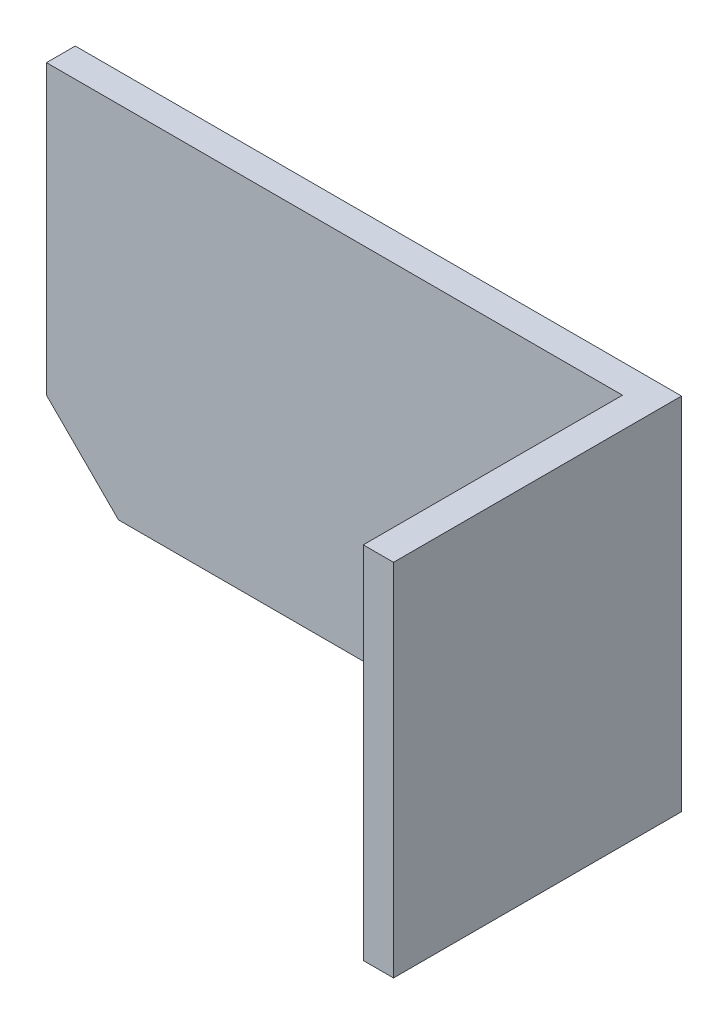
ISO-10303-21;
HEADER;
FILE_DESCRIPTION(('STEP AP214'),'2;1');
FILE_NAME('part.step','',(''),(''),'','','');
FILE_SCHEMA(('AUTOMOTIVE_DESIGN { 1 0 10303 214 1 1 1 1 }'));
ENDSEC;
DATA;
#1=APPLICATION_CONTEXT('core data for automotive mechanical design processes');
#2=APPLICATION_PROTOCOL_DEFINITION('international standard','automotive_design',2000,#1);
#3=PRODUCT_CONTEXT('',#1,'mechanical');
#4=PRODUCT('Part','Part','',(#3));
#5=PRODUCT_RELATED_PRODUCT_CATEGORY('part','',(#4));
#6=PRODUCT_DEFINITION_FORMATION('','',#4);
#7=PRODUCT_DEFINITION_CONTEXT('part definition',#1,'design');
#8=PRODUCT_DEFINITION('design','',#6,#7);
#9=PRODUCT_DEFINITION_SHAPE('','',#8);
#10=(LENGTH_UNIT() NAMED_UNIT(*) SI_UNIT(.MILLI.,.METRE.));
#11=(NAMED_UNIT(*) PLANE_ANGLE_UNIT() SI_UNIT($,.RADIAN.));
#12=(NAMED_UNIT(*) SI_UNIT($,.STERADIAN.) SOLID_ANGLE_UNIT());
#13=UNCERTAINTY_MEASURE_WITH_UNIT(LENGTH_MEASURE(1.E-05),#10,'distance_accuracy_value','');
#14=(GEOMETRIC_REPRESENTATION_CONTEXT(3) GLOBAL_UNCERTAINTY_ASSIGNED_CONTEXT((#13)) GLOBAL_UNIT_ASSIGNED_CONTEXT((#10,
#11,#12)) REPRESENTATION_CONTEXT('',''));
#15=CARTESIAN_POINT('',(0.,0.,0.));
#16=DIRECTION('',(0.,0.,1.));
#17=DIRECTION('',(1.,0.,0.));
#18=AXIS2_PLACEMENT_3D('',#15,#16,#17);
#19=CARTESIAN_POINT('',(1.48217930040456,-0.75,0.2));
#20=DIRECTION('',(0.,0.,1.));
#21=DIRECTION('',(1.,0.,0.));
#22=AXIS2_PLACEMENT_3D('',#19,#20,#21);
#23=PLANE('',#22);
#24=DIRECTION('',(0.,-1.,0.));
#25=VECTOR('',#24,1.);
#26=CARTESIAN_POINT('',(1.49267930040456,-0.75,0.2));
#27=LINE('',#26,#25);
#28=CARTESIAN_POINT('',(1.49267930040456,-0.625,0.2));
#29=VERTEX_POINT('',#28);
#30=CARTESIAN_POINT('',(1.49267930040456,-0.875,0.2));
#31=VERTEX_POINT('',#30);
#32=EDGE_CURVE('E91',#29,#31,#27,.T.);
#33=ORIENTED_EDGE('',*,*,#32,.F.);
#34=DIRECTION('',(1.,0.,0.));
#35=VECTOR('',#34,1.);
#36=CARTESIAN_POINT('',(1.34015031489732,-0.625,0.2));
#37=LINE('',#36,#35);
#38=CARTESIAN_POINT('',(1.47167930040457,-0.625,0.2));
#39=VERTEX_POINT('',#38);
#40=EDGE_CURVE('E94',#39,#29,#37,.T.);
#41=ORIENTED_EDGE('',*,*,#40,.F.);
#42=DIRECTION('',(0.,-1.,0.));
#43=VECTOR('',#42,1.);
#44=CARTESIAN_POINT('',(1.47167930040457,-0.75,0.2));
#45=LINE('',#44,#43);
#46=CARTESIAN_POINT('',(1.47167930040457,-0.875,0.2));
#47=VERTEX_POINT('',#46);
#48=EDGE_CURVE('E11',#39,#47,#45,.T.);
#49=ORIENTED_EDGE('',*,*,#48,.T.);
#50=DIRECTION('',(1.,0.,0.));
#51=VECTOR('',#50,1.);
#52=CARTESIAN_POINT('',(1.36234567518565,-0.875,0.2));
#53=LINE('',#52,#51);
#54=EDGE_CURVE('E97',#47,#31,#53,.T.);
#55=ORIENTED_EDGE('',*,*,#54,.T.);
#56=EDGE_LOOP('',(#33,#41,#49,#55));
#57=FACE_BOUND('',#56,.T.);
#58=ADVANCED_FACE('F17',(#57),#23,.T.);
#59=CARTESIAN_POINT('',(1.27669667488565,-0.746711342510853,0.02));
#60=DIRECTION('',(0.,0.,1.));
#61=DIRECTION('',(1.,0.,0.));
#62=AXIS2_PLACEMENT_3D('',#59,#60,#61);
#63=PLANE('',#62);
#64=DIRECTION('',(0.707106781186547,-0.707106781186548,0.));
#65=VECTOR('',#64,1.);
#66=CARTESIAN_POINT('',(1.09667930040456,-0.85,0.02));
#67=LINE('',#66,#65);
#68=CARTESIAN_POINT('',(1.07167930040456,-0.825,0.02));
#69=VERTEX_POINT('',#68);
#70=CARTESIAN_POINT('',(1.12167930040456,-0.875,0.02));
#71=VERTEX_POINT('',#70);
#72=EDGE_CURVE('E149',#69,#71,#67,.T.);
#73=ORIENTED_EDGE('',*,*,#72,.T.);
#74=DIRECTION('',(1.,0.,0.));
#75=VECTOR('',#74,1.);
#76=CARTESIAN_POINT('',(1.36234567518565,-0.875,0.02));
#77=LINE('',#76,#75);
#78=CARTESIAN_POINT('',(1.47167930040457,-0.875,0.02));
#79=VERTEX_POINT('',#78);
#80=EDGE_CURVE('E138',#71,#79,#77,.T.);
#81=ORIENTED_EDGE('',*,*,#80,.T.);
#82=DIRECTION('',(0.,1.,0.));
#83=VECTOR('',#82,1.);
#84=CARTESIAN_POINT('',(1.47167930040457,-0.75,0.02));
#85=LINE('',#84,#83);
#86=CARTESIAN_POINT('',(1.47167930040457,-0.625,0.02));
#87=VERTEX_POINT('',#86);
#88=EDGE_CURVE('E26',#79,#87,#85,.T.);
#89=ORIENTED_EDGE('',*,*,#88,.T.);
#90=DIRECTION('',(1.,0.,0.));
#91=VECTOR('',#90,1.);
#92=CARTESIAN_POINT('',(1.34015031489732,-0.625,0.02));
#93=LINE('',#92,#91);
#94=CARTESIAN_POINT('',(1.07167930040456,-0.625,0.02));
#95=VERTEX_POINT('',#94);
#96=EDGE_CURVE('E124',#95,#87,#93,.T.);
#97=ORIENTED_EDGE('',*,*,#96,.F.);
#98=DIRECTION('',(0.,-1.,0.));
#99=VECTOR('',#98,1.);
#100=CARTESIAN_POINT('',(1.07167930040456,-0.725,0.02));
#101=LINE('',#100,#99);
#102=EDGE_CURVE('E38',#95,#69,#101,.T.);
#103=ORIENTED_EDGE('',*,*,#102,.T.);
#104=EDGE_LOOP('',(#73,#81,#89,#97,#103));
#105=FACE_BOUND('',#104,.T.);
#106=ADVANCED_FACE('F164',(#105),#63,.T.);
#107=CARTESIAN_POINT('',(1.47167930040457,-0.75,0.11));
#108=DIRECTION('',(1.,0.,0.));
#109=DIRECTION('',(0.,0.,1.));
#110=AXIS2_PLACEMENT_3D('',#107,#108,#109);
#111=PLANE('',#110);
#112=DIRECTION('',(0.,0.,1.));
#113=VECTOR('',#112,1.);
#114=CARTESIAN_POINT('',(1.47167930040457,-0.625,0.0420289855072459));
#115=LINE('',#114,#113);
#116=EDGE_CURVE('E117',#87,#39,#115,.T.);
#117=ORIENTED_EDGE('',*,*,#116,.F.);
#118=ORIENTED_EDGE('',*,*,#88,.F.);
#119=DIRECTION('',(0.,0.,1.));
#120=VECTOR('',#119,1.);
#121=CARTESIAN_POINT('',(1.47167930040457,-0.875,0.0448336252189136));
#122=LINE('',#121,#120);
#123=EDGE_CURVE('E135',#79,#47,#122,.T.);
#124=ORIENTED_EDGE('',*,*,#123,.T.);
#125=ORIENTED_EDGE('',*,*,#48,.F.);
#126=EDGE_LOOP('',(#117,#118,#124,#125));
#127=FACE_BOUND('',#126,.T.);
#128=ADVANCED_FACE('F168',(#127),#111,.F.);
#129=CARTESIAN_POINT('',(1.07167930040456,-0.725,0.01));
#130=DIRECTION('',(1.,0.,0.));
#131=DIRECTION('',(0.,0.,1.));
#132=AXIS2_PLACEMENT_3D('',#129,#130,#131);
#133=PLANE('',#132);
#134=DIRECTION('',(0.,0.,1.));
#135=VECTOR('',#134,1.);
#136=CARTESIAN_POINT('',(1.07167930040456,-0.825,0.01));
#137=LINE('',#136,#135);
#138=CARTESIAN_POINT('',(1.07167930040456,-0.825,0.));
#139=VERTEX_POINT('',#138);
#140=EDGE_CURVE('E157',#139,#69,#137,.T.);
#141=ORIENTED_EDGE('',*,*,#140,.T.);
#142=ORIENTED_EDGE('',*,*,#102,.F.);
#143=DIRECTION('',(0.,0.,1.));
#144=VECTOR('',#143,1.);
#145=CARTESIAN_POINT('',(1.07167930040456,-0.625,0.0420289855072459));
#146=LINE('',#145,#144);
#147=CARTESIAN_POINT('',(1.07167930040456,-0.625,0.));
#148=VERTEX_POINT('',#147);
#149=EDGE_CURVE('E102',#148,#95,#146,.T.);
#150=ORIENTED_EDGE('',*,*,#149,.F.);
#151=DIRECTION('',(0.,-1.,0.));
#152=VECTOR('',#151,1.);
#153=CARTESIAN_POINT('',(1.07167930040456,-0.746816562660918,0.));
#154=LINE('',#153,#152);
#155=EDGE_CURVE('E128',#148,#139,#154,.T.);
#156=ORIENTED_EDGE('',*,*,#155,.T.);
#157=EDGE_LOOP('',(#141,#142,#150,#156));
#158=FACE_BOUND('',#157,.T.);
#159=ADVANCED_FACE('F172',(#158),#133,.F.);
#160=CARTESIAN_POINT('',(1.09667930040456,-0.85,0.01));
#161=DIRECTION('',(0.707106781186548,0.707106781186547,0.));
#162=DIRECTION('',(0.,0.,-1.));
#163=AXIS2_PLACEMENT_3D('',#160,#161,#162);
#164=PLANE('',#163);
#165=DIRECTION('',(0.,0.,1.));
#166=VECTOR('',#165,1.);
#167=CARTESIAN_POINT('',(1.12167930040456,-0.875,0.0448336252189136));
#168=LINE('',#167,#166);
#169=CARTESIAN_POINT('',(1.12167930040456,-0.875,0.));
#170=VERTEX_POINT('',#169);
#171=EDGE_CURVE('E145',#170,#71,#168,.T.);
#172=ORIENTED_EDGE('',*,*,#171,.T.);
#173=ORIENTED_EDGE('',*,*,#72,.F.);
#174=ORIENTED_EDGE('',*,*,#140,.F.);
#175=DIRECTION('',(0.707106781186538,-0.707106781186557,0.));
#176=VECTOR('',#175,1.);
#177=CARTESIAN_POINT('',(1.07167930040456,-0.825,0.));
#178=LINE('',#177,#176);
#179=EDGE_CURVE('E178',#139,#170,#178,.T.);
#180=ORIENTED_EDGE('',*,*,#179,.T.);
#181=EDGE_LOOP('',(#172,#173,#174,#180));
#182=FACE_BOUND('',#181,.T.);
#183=ADVANCED_FACE('F177',(#182),#164,.F.);
#184=CARTESIAN_POINT('',(1.36234567518565,-0.875,0.0448336252189136));
#185=DIRECTION('',(0.,1.,0.));
#186=DIRECTION('',(1.,0.,0.));
#187=AXIS2_PLACEMENT_3D('',#184,#185,#186);
#188=PLANE('',#187);
#189=DIRECTION('',(0.,0.,-1.));
#190=VECTOR('',#189,1.);
#191=CARTESIAN_POINT('',(1.49267930040456,-0.875,0.0999999999999988));
#192=LINE('',#191,#190);
#193=CARTESIAN_POINT('',(1.49267930040456,-0.875,0.));
#194=VERTEX_POINT('',#193);
#195=EDGE_CURVE('E101',#31,#194,#192,.T.);
#196=ORIENTED_EDGE('',*,*,#195,.F.);
#197=ORIENTED_EDGE('',*,*,#54,.F.);
#198=ORIENTED_EDGE('',*,*,#123,.F.);
#199=ORIENTED_EDGE('',*,*,#80,.F.);
#200=ORIENTED_EDGE('',*,*,#171,.F.);
#201=DIRECTION('',(1.,0.,0.));
#202=VECTOR('',#201,1.);
#203=CARTESIAN_POINT('',(1.28727042163972,-0.875,0.));
#204=LINE('',#203,#202);
#205=EDGE_CURVE('E183',#170,#194,#204,.T.);
#206=ORIENTED_EDGE('',*,*,#205,.T.);
#207=EDGE_LOOP('',(#196,#197,#198,#199,#200,#206));
#208=FACE_BOUND('',#207,.T.);
#209=ADVANCED_FACE('F182',(#208),#188,.F.);
#210=CARTESIAN_POINT('',(1.49267930040456,-0.75,0.0999999999999988));
#211=DIRECTION('',(1.,0.,0.));
#212=DIRECTION('',(0.,0.,-1.));
#213=AXIS2_PLACEMENT_3D('',#210,#211,#212);
#214=PLANE('',#213);
#215=ORIENTED_EDGE('',*,*,#32,.T.);
#216=ORIENTED_EDGE('',*,*,#195,.T.);
#217=DIRECTION('',(0.,1.,0.));
#218=VECTOR('',#217,1.);
#219=CARTESIAN_POINT('',(1.49267930040456,-0.746816562660918,0.));
#220=LINE('',#219,#218);
#221=CARTESIAN_POINT('',(1.49267930040456,-0.625,0.));
#222=VERTEX_POINT('',#221);
#223=EDGE_CURVE('E108',#194,#222,#220,.T.);
#224=ORIENTED_EDGE('',*,*,#223,.T.);
#225=DIRECTION('',(0.,0.,-1.));
#226=VECTOR('',#225,1.);
#227=CARTESIAN_POINT('',(1.49267930040456,-0.625,0.0420289855072459));
#228=LINE('',#227,#226);
#229=EDGE_CURVE('E105',#29,#222,#228,.T.);
#230=ORIENTED_EDGE('',*,*,#229,.F.);
#231=EDGE_LOOP('',(#215,#216,#224,#230));
#232=FACE_BOUND('',#231,.T.);
#233=ADVANCED_FACE('F106',(#232),#214,.T.);
#234=CARTESIAN_POINT('',(1.34015031489732,-0.625,0.0420289855072459));
#235=DIRECTION('',(0.,1.,0.));
#236=DIRECTION('',(0.,0.,-1.));
#237=AXIS2_PLACEMENT_3D('',#234,#235,#236);
#238=PLANE('',#237);
#239=ORIENTED_EDGE('',*,*,#96,.T.);
#240=ORIENTED_EDGE('',*,*,#116,.T.);
#241=ORIENTED_EDGE('',*,*,#40,.T.);
#242=ORIENTED_EDGE('',*,*,#229,.T.);
#243=DIRECTION('',(-1.,0.,0.));
#244=VECTOR('',#243,1.);
#245=CARTESIAN_POINT('',(1.28727042163972,-0.625,0.));
#246=LINE('',#245,#244);
#247=EDGE_CURVE('E130',#222,#148,#246,.T.);
#248=ORIENTED_EDGE('',*,*,#247,.T.);
#249=ORIENTED_EDGE('',*,*,#149,.T.);
#250=EDGE_LOOP('',(#239,#240,#241,#242,#248,#249));
#251=FACE_BOUND('',#250,.T.);
#252=ADVANCED_FACE('F115',(#251),#238,.T.);
#253=CARTESIAN_POINT('',(1.28727042163972,-0.746816562660918,0.));
#254=DIRECTION('',(0.,0.,1.));
#255=DIRECTION('',(1.,0.,0.));
#256=AXIS2_PLACEMENT_3D('',#253,#254,#255);
#257=PLANE('',#256);
#258=ORIENTED_EDGE('',*,*,#223,.F.);
#259=ORIENTED_EDGE('',*,*,#205,.F.);
#260=ORIENTED_EDGE('',*,*,#179,.F.);
#261=ORIENTED_EDGE('',*,*,#155,.F.);
#262=ORIENTED_EDGE('',*,*,#247,.F.);
#263=EDGE_LOOP('',(#258,#259,#260,#261,#262));
#264=FACE_BOUND('',#263,.T.);
#265=ADVANCED_FACE('F187',(#264),#257,.F.);
#266=CLOSED_SHELL('',(#58,#106,#128,#159,#183,#209,#233,#252,#265));
#267=MANIFOLD_SOLID_BREP('B1',#266);
#268=ADVANCED_BREP_SHAPE_REPRESENTATION('',(#18,#267),#14);
#269=SHAPE_DEFINITION_REPRESENTATION(#9,#268);
ENDSEC;
END-ISO-10303-21;
